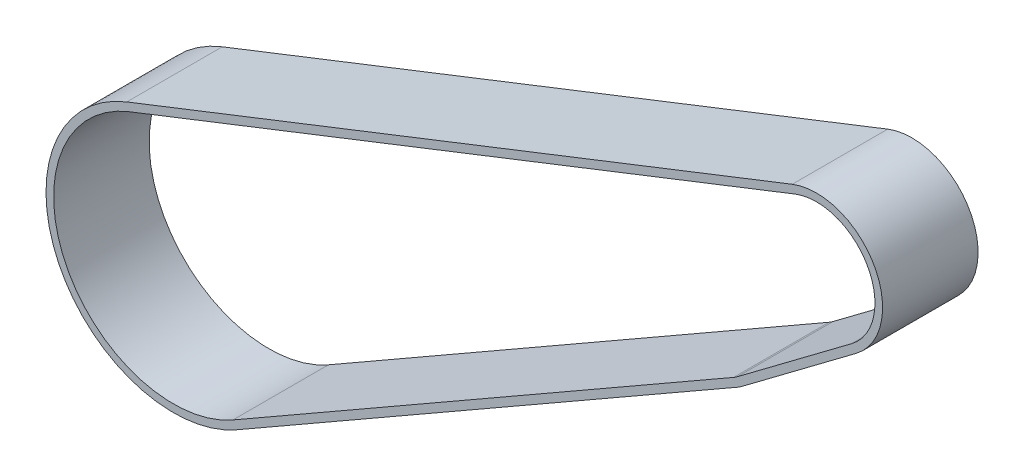
ISO-10303-21;
HEADER;
FILE_DESCRIPTION(('STEP AP214'),'2;1');
FILE_NAME('part.step','',(''),(''),'','','');
FILE_SCHEMA(('AUTOMOTIVE_DESIGN { 1 0 10303 214 1 1 1 1 }'));
ENDSEC;
DATA;
#1=APPLICATION_CONTEXT('core data for automotive mechanical design processes');
#2=APPLICATION_PROTOCOL_DEFINITION('international standard','automotive_design',2000,#1);
#3=PRODUCT_CONTEXT('',#1,'mechanical');
#4=PRODUCT('Part','Part','',(#3));
#5=PRODUCT_RELATED_PRODUCT_CATEGORY('part','',(#4));
#6=PRODUCT_DEFINITION_FORMATION('','',#4);
#7=PRODUCT_DEFINITION_CONTEXT('part definition',#1,'design');
#8=PRODUCT_DEFINITION('design','',#6,#7);
#9=PRODUCT_DEFINITION_SHAPE('','',#8);
#10=(LENGTH_UNIT() NAMED_UNIT(*) SI_UNIT(.MILLI.,.METRE.));
#11=(NAMED_UNIT(*) PLANE_ANGLE_UNIT() SI_UNIT($,.RADIAN.));
#12=(NAMED_UNIT(*) SI_UNIT($,.STERADIAN.) SOLID_ANGLE_UNIT());
#13=UNCERTAINTY_MEASURE_WITH_UNIT(LENGTH_MEASURE(1.E-05),#10,'distance_accuracy_value','');
#14=(GEOMETRIC_REPRESENTATION_CONTEXT(3) GLOBAL_UNCERTAINTY_ASSIGNED_CONTEXT((#13)) GLOBAL_UNIT_ASSIGNED_CONTEXT((#10,
#11,#12)) REPRESENTATION_CONTEXT('',''));
#15=CARTESIAN_POINT('',(0.,0.,0.));
#16=DIRECTION('',(0.,0.,1.));
#17=DIRECTION('',(1.,0.,0.));
#18=AXIS2_PLACEMENT_3D('',#15,#16,#17);
#19=CARTESIAN_POINT('',(-336.89025787332,-23.2314605364085,15.));
#20=DIRECTION('',(0.,0.,1.));
#21=DIRECTION('',(1.,0.,0.));
#22=AXIS2_PLACEMENT_3D('',#19,#20,#21);
#23=PLANE('',#22);
#24=CARTESIAN_POINT('',(-336.89025787332,-23.2314605364085,15.));
#25=DIRECTION('',(0.,0.,1.));
#26=DIRECTION('',(1.,0.,0.));
#27=AXIS2_PLACEMENT_3D('',#24,#25,#26);
#28=CIRCLE('',#27,10.3936776492283);
#29=CARTESIAN_POINT('',(-330.651704705237,-31.5446422044022,15.));
#30=VERTEX_POINT('',#29);
#31=CARTESIAN_POINT('',(-340.690762011991,-13.5575418181219,15.));
#32=VERTEX_POINT('',#31);
#33=EDGE_CURVE('E234',#30,#32,#28,.T.);
#34=ORIENTED_EDGE('',*,*,#33,.T.);
#35=DIRECTION('',(-0.93075031233096,-0.365655378868984,0.));
#36=VECTOR('',#35,1.);
#37=CARTESIAN_POINT('',(-340.690762011991,-13.5575418181219,15.));
#38=LINE('',#37,#36);
#39=CARTESIAN_POINT('',(-445.203365450699,-54.6164542897791,15.));
#40=VERTEX_POINT('',#39);
#41=EDGE_CURVE('E238',#32,#40,#38,.T.);
#42=ORIENTED_EDGE('',*,*,#41,.T.);
#43=CARTESIAN_POINT('',(-437.890257873319,-73.2314605363983,15.));
#44=DIRECTION('',(0.,0.,1.));
#45=DIRECTION('',(1.,0.,0.));
#46=AXIS2_PLACEMENT_3D('',#43,#44,#45);
#47=CIRCLE('',#46,20.);
#48=CARTESIAN_POINT('',(-427.939056890706,-90.5800512285453,15.));
#49=VERTEX_POINT('',#48);
#50=EDGE_CURVE('E242',#40,#49,#47,.T.);
#51=ORIENTED_EDGE('',*,*,#50,.T.);
#52=DIRECTION('',(0.867429534607351,0.497560049130631,0.));
#53=VECTOR('',#52,1.);
#54=CARTESIAN_POINT('',(-427.939056890706,-90.5800512285453,15.));
#55=LINE('',#54,#53);
#56=CARTESIAN_POINT('',(-349.307825521008,-45.4769531870212,15.));
#57=VERTEX_POINT('',#56);
#58=EDGE_CURVE('E245',#49,#57,#55,.T.);
#59=ORIENTED_EDGE('',*,*,#58,.T.);
#60=CARTESIAN_POINT('',(-352.890257874749,-39.2314605378483,15.));
#61=DIRECTION('',(0.,0.,1.));
#62=DIRECTION('',(1.,0.,0.));
#63=AXIS2_PLACEMENT_3D('',#60,#61,#62);
#64=CIRCLE('',#63,7.2);
#65=CARTESIAN_POINT('',(-348.568632332174,-44.990241022444,15.));
#66=VERTEX_POINT('',#65);
#67=EDGE_CURVE('E248',#57,#66,#64,.T.);
#68=ORIENTED_EDGE('',*,*,#67,.T.);
#69=DIRECTION('',(0.799830622860516,0.60022576980213,0.));
#70=VECTOR('',#69,1.);
#71=CARTESIAN_POINT('',(-348.568632332174,-44.990241022444,15.));
#72=LINE('',#71,#70);
#73=EDGE_CURVE('E251',#66,#30,#72,.T.);
#74=ORIENTED_EDGE('',*,*,#73,.T.);
#75=EDGE_LOOP('',(#34,#42,#51,#59,#68,#74));
#76=FACE_BOUND('',#75,.T.);
#77=DIRECTION('',(-0.93075031233096,-0.365655378868984,0.));
#78=VECTOR('',#77,1.);
#79=CARTESIAN_POINT('',(-340.251975557348,-14.674442192919,15.));
#80=LINE('',#79,#78);
#81=CARTESIAN_POINT('',(-340.251975557348,-14.674442192919,15.));
#82=VERTEX_POINT('',#81);
#83=CARTESIAN_POINT('',(-444.764578996056,-55.7333546645762,15.));
#84=VERTEX_POINT('',#83);
#85=EDGE_CURVE('E174',#82,#84,#80,.T.);
#86=ORIENTED_EDGE('',*,*,#85,.F.);
#87=CARTESIAN_POINT('',(-336.89025787332,-23.2314605364085,15.));
#88=DIRECTION('',(0.,0.,1.));
#89=DIRECTION('',(1.,0.,0.));
#90=AXIS2_PLACEMENT_3D('',#87,#88,#89);
#91=CIRCLE('',#90,9.19367764922834);
#92=CARTESIAN_POINT('',(-331.371975629,-30.5848454569696,15.));
#93=VERTEX_POINT('',#92);
#94=EDGE_CURVE('E165',#93,#82,#91,.T.);
#95=ORIENTED_EDGE('',*,*,#94,.F.);
#96=DIRECTION('',(0.799830622860516,0.60022576980213,0.));
#97=VECTOR('',#96,1.);
#98=CARTESIAN_POINT('',(-349.288903255936,-44.0304442750114,15.));
#99=LINE('',#98,#97);
#100=CARTESIAN_POINT('',(-349.288903255936,-44.0304442750113,15.));
#101=VERTEX_POINT('',#100);
#102=EDGE_CURVE('E200',#101,#93,#99,.T.);
#103=ORIENTED_EDGE('',*,*,#102,.F.);
#104=CARTESIAN_POINT('',(-352.890257874749,-39.2314605378483,15.));
#105=DIRECTION('',(0.,0.,1.));
#106=DIRECTION('',(1.,0.,0.));
#107=AXIS2_PLACEMENT_3D('',#104,#105,#106);
#108=CIRCLE('',#107,6.00000000000001);
#109=CARTESIAN_POINT('',(-349.904897579965,-44.4360377454924,15.));
#110=VERTEX_POINT('',#109);
#111=EDGE_CURVE('E197',#110,#101,#108,.T.);
#112=ORIENTED_EDGE('',*,*,#111,.F.);
#113=DIRECTION('',(0.86742953460735,0.497560049130631,0.));
#114=VECTOR('',#113,1.);
#115=CARTESIAN_POINT('',(-428.536128949663,-89.5391357870165,15.));
#116=LINE('',#115,#114);
#117=CARTESIAN_POINT('',(-428.536128949663,-89.5391357870165,15.));
#118=VERTEX_POINT('',#117);
#119=EDGE_CURVE('E192',#118,#110,#116,.T.);
#120=ORIENTED_EDGE('',*,*,#119,.F.);
#121=CARTESIAN_POINT('',(-437.890257873319,-73.2314605363983,15.));
#122=DIRECTION('',(0.,0.,1.));
#123=DIRECTION('',(1.,0.,0.));
#124=AXIS2_PLACEMENT_3D('',#121,#122,#123);
#125=CIRCLE('',#124,18.8);
#126=EDGE_CURVE('E188',#84,#118,#125,.T.);
#127=ORIENTED_EDGE('',*,*,#126,.F.);
#128=EDGE_LOOP('',(#86,#95,#103,#112,#120,#127));
#129=FACE_BOUND('',#128,.T.);
#130=ADVANCED_FACE('F75',(#76,#129),#23,.T.);
#131=CARTESIAN_POINT('',(-336.89025787332,-23.2314605364085,0.));
#132=DIRECTION('',(0.,0.,1.));
#133=DIRECTION('',(1.,0.,0.));
#134=AXIS2_PLACEMENT_3D('',#131,#132,#133);
#135=PLANE('',#134);
#136=CARTESIAN_POINT('',(-336.89025787332,-23.2314605364085,0.));
#137=DIRECTION('',(0.,0.,1.));
#138=DIRECTION('',(1.,0.,0.));
#139=AXIS2_PLACEMENT_3D('',#136,#137,#138);
#140=CIRCLE('',#139,10.3936776492283);
#141=CARTESIAN_POINT('',(-330.651704705237,-31.5446422044022,0.));
#142=VERTEX_POINT('',#141);
#143=CARTESIAN_POINT('',(-340.690762011991,-13.5575418181219,0.));
#144=VERTEX_POINT('',#143);
#145=EDGE_CURVE('E183',#142,#144,#140,.T.);
#146=ORIENTED_EDGE('',*,*,#145,.F.);
#147=DIRECTION('',(0.799830622860516,0.60022576980213,0.));
#148=VECTOR('',#147,1.);
#149=CARTESIAN_POINT('',(-348.568632332174,-44.990241022444,0.));
#150=LINE('',#149,#148);
#151=CARTESIAN_POINT('',(-348.568632332174,-44.990241022444,0.));
#152=VERTEX_POINT('',#151);
#153=EDGE_CURVE('E239',#152,#142,#150,.T.);
#154=ORIENTED_EDGE('',*,*,#153,.F.);
#155=CARTESIAN_POINT('',(-352.890257874749,-39.2314605378483,0.));
#156=DIRECTION('',(0.,0.,1.));
#157=DIRECTION('',(1.,0.,0.));
#158=AXIS2_PLACEMENT_3D('',#155,#156,#157);
#159=CIRCLE('',#158,7.2);
#160=CARTESIAN_POINT('',(-349.307825521008,-45.4769531870212,0.));
#161=VERTEX_POINT('',#160);
#162=EDGE_CURVE('E267',#161,#152,#159,.T.);
#163=ORIENTED_EDGE('',*,*,#162,.F.);
#164=DIRECTION('',(0.867429534607351,0.497560049130631,0.));
#165=VECTOR('',#164,1.);
#166=CARTESIAN_POINT('',(-427.939056890706,-90.5800512285453,0.));
#167=LINE('',#166,#165);
#168=CARTESIAN_POINT('',(-427.939056890706,-90.5800512285453,0.));
#169=VERTEX_POINT('',#168);
#170=EDGE_CURVE('E264',#169,#161,#167,.T.);
#171=ORIENTED_EDGE('',*,*,#170,.F.);
#172=CARTESIAN_POINT('',(-437.890257873319,-73.2314605363983,0.));
#173=DIRECTION('',(0.,0.,1.));
#174=DIRECTION('',(1.,0.,0.));
#175=AXIS2_PLACEMENT_3D('',#172,#173,#174);
#176=CIRCLE('',#175,20.);
#177=CARTESIAN_POINT('',(-445.203365450699,-54.6164542897791,0.));
#178=VERTEX_POINT('',#177);
#179=EDGE_CURVE('E261',#178,#169,#176,.T.);
#180=ORIENTED_EDGE('',*,*,#179,.F.);
#181=DIRECTION('',(-0.93075031233096,-0.365655378868984,0.));
#182=VECTOR('',#181,1.);
#183=CARTESIAN_POINT('',(-340.690762011991,-13.5575418181219,0.));
#184=LINE('',#183,#182);
#185=EDGE_CURVE('E258',#144,#178,#184,.T.);
#186=ORIENTED_EDGE('',*,*,#185,.F.);
#187=EDGE_LOOP('',(#146,#154,#163,#171,#180,#186));
#188=FACE_BOUND('',#187,.T.);
#189=CARTESIAN_POINT('',(-336.89025787332,-23.2314605364085,0.));
#190=DIRECTION('',(0.,0.,1.));
#191=DIRECTION('',(1.,0.,0.));
#192=AXIS2_PLACEMENT_3D('',#189,#190,#191);
#193=CIRCLE('',#192,9.19367764922834);
#194=CARTESIAN_POINT('',(-331.371975629,-30.5848454569696,0.));
#195=VERTEX_POINT('',#194);
#196=CARTESIAN_POINT('',(-340.251975557348,-14.674442192919,0.));
#197=VERTEX_POINT('',#196);
#198=EDGE_CURVE('E99',#195,#197,#193,.T.);
#199=ORIENTED_EDGE('',*,*,#198,.T.);
#200=DIRECTION('',(-0.93075031233096,-0.365655378868984,0.));
#201=VECTOR('',#200,1.);
#202=CARTESIAN_POINT('',(-340.251975557348,-14.674442192919,0.));
#203=LINE('',#202,#201);
#204=CARTESIAN_POINT('',(-444.764578996056,-55.7333546645762,0.));
#205=VERTEX_POINT('',#204);
#206=EDGE_CURVE('E181',#197,#205,#203,.T.);
#207=ORIENTED_EDGE('',*,*,#206,.T.);
#208=CARTESIAN_POINT('',(-437.890257873319,-73.2314605363983,0.));
#209=DIRECTION('',(0.,0.,1.));
#210=DIRECTION('',(1.,0.,0.));
#211=AXIS2_PLACEMENT_3D('',#208,#209,#210);
#212=CIRCLE('',#211,18.8);
#213=CARTESIAN_POINT('',(-428.536128949663,-89.5391357870165,0.));
#214=VERTEX_POINT('',#213);
#215=EDGE_CURVE('E207',#205,#214,#212,.T.);
#216=ORIENTED_EDGE('',*,*,#215,.T.);
#217=DIRECTION('',(0.86742953460735,0.497560049130631,0.));
#218=VECTOR('',#217,1.);
#219=CARTESIAN_POINT('',(-428.536128949663,-89.5391357870165,0.));
#220=LINE('',#219,#218);
#221=CARTESIAN_POINT('',(-349.904897579965,-44.4360377454924,0.));
#222=VERTEX_POINT('',#221);
#223=EDGE_CURVE('E211',#214,#222,#220,.T.);
#224=ORIENTED_EDGE('',*,*,#223,.T.);
#225=CARTESIAN_POINT('',(-352.890257874749,-39.2314605378483,0.));
#226=DIRECTION('',(0.,0.,1.));
#227=DIRECTION('',(1.,0.,0.));
#228=AXIS2_PLACEMENT_3D('',#225,#226,#227);
#229=CIRCLE('',#228,6.00000000000001);
#230=CARTESIAN_POINT('',(-349.288903255936,-44.0304442750114,0.));
#231=VERTEX_POINT('',#230);
#232=EDGE_CURVE('E215',#222,#231,#229,.T.);
#233=ORIENTED_EDGE('',*,*,#232,.T.);
#234=DIRECTION('',(0.799830622860516,0.60022576980213,0.));
#235=VECTOR('',#234,1.);
#236=CARTESIAN_POINT('',(-349.288903255936,-44.0304442750114,0.));
#237=LINE('',#236,#235);
#238=EDGE_CURVE('E175',#231,#195,#237,.T.);
#239=ORIENTED_EDGE('',*,*,#238,.T.);
#240=EDGE_LOOP('',(#199,#207,#216,#224,#233,#239));
#241=FACE_BOUND('',#240,.T.);
#242=ADVANCED_FACE('F298',(#188,#241),#135,.F.);
#243=CARTESIAN_POINT('',(-336.89025787332,-23.2314605364085,15.));
#244=DIRECTION('',(0.,0.,-1.));
#245=DIRECTION('',(-1.,0.,0.));
#246=AXIS2_PLACEMENT_3D('',#243,#244,#245);
#247=CYLINDRICAL_SURFACE('',#246,10.3936776492283);
#248=ORIENTED_EDGE('',*,*,#145,.T.);
#249=DIRECTION('',(0.,0.,-1.));
#250=VECTOR('',#249,1.);
#251=CARTESIAN_POINT('',(-340.690762011991,-13.5575418181219,15.));
#252=LINE('',#251,#250);
#253=EDGE_CURVE('E12',#32,#144,#252,.T.);
#254=ORIENTED_EDGE('',*,*,#253,.F.);
#255=ORIENTED_EDGE('',*,*,#33,.F.);
#256=DIRECTION('',(0.,0.,-1.));
#257=VECTOR('',#256,1.);
#258=CARTESIAN_POINT('',(-330.651704705237,-31.5446422044022,15.));
#259=LINE('',#258,#257);
#260=EDGE_CURVE('E254',#30,#142,#259,.T.);
#261=ORIENTED_EDGE('',*,*,#260,.T.);
#262=EDGE_LOOP('',(#248,#254,#255,#261));
#263=FACE_BOUND('',#262,.T.);
#264=ADVANCED_FACE('F77',(#263),#247,.T.);
#265=CARTESIAN_POINT('',(-340.690762011991,-13.5575418181219,15.));
#266=DIRECTION('',(0.365655378868984,-0.93075031233096,0.));
#267=DIRECTION('',(0.93075031233096,0.365655378868984,0.));
#268=AXIS2_PLACEMENT_3D('',#265,#266,#267);
#269=PLANE('',#268);
#270=ORIENTED_EDGE('',*,*,#185,.T.);
#271=DIRECTION('',(0.,0.,-1.));
#272=VECTOR('',#271,1.);
#273=CARTESIAN_POINT('',(-445.203365450699,-54.6164542897791,15.));
#274=LINE('',#273,#272);
#275=EDGE_CURVE('E84',#40,#178,#274,.T.);
#276=ORIENTED_EDGE('',*,*,#275,.F.);
#277=ORIENTED_EDGE('',*,*,#41,.F.);
#278=ORIENTED_EDGE('',*,*,#253,.T.);
#279=EDGE_LOOP('',(#270,#276,#277,#278));
#280=FACE_BOUND('',#279,.T.);
#281=ADVANCED_FACE('F315',(#280),#269,.F.);
#282=CARTESIAN_POINT('',(-437.890257873319,-73.2314605363983,15.));
#283=DIRECTION('',(0.,0.,-1.));
#284=DIRECTION('',(-1.,0.,0.));
#285=AXIS2_PLACEMENT_3D('',#282,#283,#284);
#286=CYLINDRICAL_SURFACE('',#285,20.);
#287=ORIENTED_EDGE('',*,*,#179,.T.);
#288=DIRECTION('',(0.,0.,-1.));
#289=VECTOR('',#288,1.);
#290=CARTESIAN_POINT('',(-427.939056890706,-90.5800512285453,15.));
#291=LINE('',#290,#289);
#292=EDGE_CURVE('E283',#49,#169,#291,.T.);
#293=ORIENTED_EDGE('',*,*,#292,.F.);
#294=ORIENTED_EDGE('',*,*,#50,.F.);
#295=ORIENTED_EDGE('',*,*,#275,.T.);
#296=EDGE_LOOP('',(#287,#293,#294,#295));
#297=FACE_BOUND('',#296,.T.);
#298=ADVANCED_FACE('F292',(#297),#286,.T.);
#299=CARTESIAN_POINT('',(-427.939056890706,-90.5800512285453,15.));
#300=DIRECTION('',(-0.497560049130631,0.86742953460735,0.));
#301=DIRECTION('',(-0.86742953460735,-0.497560049130631,0.));
#302=AXIS2_PLACEMENT_3D('',#299,#300,#301);
#303=PLANE('',#302);
#304=ORIENTED_EDGE('',*,*,#170,.T.);
#305=DIRECTION('',(0.,0.,-1.));
#306=VECTOR('',#305,1.);
#307=CARTESIAN_POINT('',(-349.307825521008,-45.4769531870212,15.));
#308=LINE('',#307,#306);
#309=EDGE_CURVE('E279',#57,#161,#308,.T.);
#310=ORIENTED_EDGE('',*,*,#309,.F.);
#311=ORIENTED_EDGE('',*,*,#58,.F.);
#312=ORIENTED_EDGE('',*,*,#292,.T.);
#313=EDGE_LOOP('',(#304,#310,#311,#312));
#314=FACE_BOUND('',#313,.T.);
#315=ADVANCED_FACE('F304',(#314),#303,.F.);
#316=CARTESIAN_POINT('',(-352.890257874749,-39.2314605378483,15.));
#317=DIRECTION('',(0.,0.,-1.));
#318=DIRECTION('',(-1.,0.,0.));
#319=AXIS2_PLACEMENT_3D('',#316,#317,#318);
#320=CYLINDRICAL_SURFACE('',#319,7.2);
#321=ORIENTED_EDGE('',*,*,#162,.T.);
#322=DIRECTION('',(0.,0.,-1.));
#323=VECTOR('',#322,1.);
#324=CARTESIAN_POINT('',(-348.568632332174,-44.990241022444,15.));
#325=LINE('',#324,#323);
#326=EDGE_CURVE('E275',#66,#152,#325,.T.);
#327=ORIENTED_EDGE('',*,*,#326,.F.);
#328=ORIENTED_EDGE('',*,*,#67,.F.);
#329=ORIENTED_EDGE('',*,*,#309,.T.);
#330=EDGE_LOOP('',(#321,#327,#328,#329));
#331=FACE_BOUND('',#330,.T.);
#332=ADVANCED_FACE('F308',(#331),#320,.T.);
#333=CARTESIAN_POINT('',(-348.568632332174,-44.990241022444,15.));
#334=DIRECTION('',(-0.60022576980213,0.799830622860516,0.));
#335=DIRECTION('',(-0.799830622860516,-0.60022576980213,0.));
#336=AXIS2_PLACEMENT_3D('',#333,#334,#335);
#337=PLANE('',#336);
#338=ORIENTED_EDGE('',*,*,#153,.T.);
#339=ORIENTED_EDGE('',*,*,#260,.F.);
#340=ORIENTED_EDGE('',*,*,#73,.F.);
#341=ORIENTED_EDGE('',*,*,#326,.T.);
#342=EDGE_LOOP('',(#338,#339,#340,#341));
#343=FACE_BOUND('',#342,.T.);
#344=ADVANCED_FACE('F318',(#343),#337,.F.);
#345=CARTESIAN_POINT('',(-336.89025787332,-23.2314605364085,15.));
#346=DIRECTION('',(0.,0.,-1.));
#347=DIRECTION('',(-1.,0.,0.));
#348=AXIS2_PLACEMENT_3D('',#345,#346,#347);
#349=CYLINDRICAL_SURFACE('',#348,9.19367764922834);
#350=ORIENTED_EDGE('',*,*,#198,.F.);
#351=DIRECTION('',(0.,0.,-1.));
#352=VECTOR('',#351,1.);
#353=CARTESIAN_POINT('',(-331.371975629,-30.5848454569696,15.));
#354=LINE('',#353,#352);
#355=EDGE_CURVE('E169',#93,#195,#354,.T.);
#356=ORIENTED_EDGE('',*,*,#355,.F.);
#357=ORIENTED_EDGE('',*,*,#94,.T.);
#358=DIRECTION('',(0.,0.,-1.));
#359=VECTOR('',#358,1.);
#360=CARTESIAN_POINT('',(-340.251975557348,-14.674442192919,15.));
#361=LINE('',#360,#359);
#362=EDGE_CURVE('E168',#82,#197,#361,.T.);
#363=ORIENTED_EDGE('',*,*,#362,.T.);
#364=EDGE_LOOP('',(#350,#356,#357,#363));
#365=FACE_BOUND('',#364,.T.);
#366=ADVANCED_FACE('F167',(#365),#349,.F.);
#367=CARTESIAN_POINT('',(-340.251975557348,-14.674442192919,15.));
#368=DIRECTION('',(0.365655378868984,-0.93075031233096,0.));
#369=DIRECTION('',(0.93075031233096,0.365655378868984,0.));
#370=AXIS2_PLACEMENT_3D('',#367,#368,#369);
#371=PLANE('',#370);
#372=ORIENTED_EDGE('',*,*,#206,.F.);
#373=ORIENTED_EDGE('',*,*,#362,.F.);
#374=ORIENTED_EDGE('',*,*,#85,.T.);
#375=DIRECTION('',(0.,0.,-1.));
#376=VECTOR('',#375,1.);
#377=CARTESIAN_POINT('',(-444.764578996056,-55.7333546645762,15.));
#378=LINE('',#377,#376);
#379=EDGE_CURVE('E184',#84,#205,#378,.T.);
#380=ORIENTED_EDGE('',*,*,#379,.T.);
#381=EDGE_LOOP('',(#372,#373,#374,#380));
#382=FACE_BOUND('',#381,.T.);
#383=ADVANCED_FACE('F178',(#382),#371,.T.);
#384=CARTESIAN_POINT('',(-437.890257873319,-73.2314605363983,15.));
#385=DIRECTION('',(0.,0.,-1.));
#386=DIRECTION('',(-1.,0.,0.));
#387=AXIS2_PLACEMENT_3D('',#384,#385,#386);
#388=CYLINDRICAL_SURFACE('',#387,18.8);
#389=ORIENTED_EDGE('',*,*,#215,.F.);
#390=ORIENTED_EDGE('',*,*,#379,.F.);
#391=ORIENTED_EDGE('',*,*,#126,.T.);
#392=DIRECTION('',(0.,0.,-1.));
#393=VECTOR('',#392,1.);
#394=CARTESIAN_POINT('',(-428.536128949663,-89.5391357870165,15.));
#395=LINE('',#394,#393);
#396=EDGE_CURVE('E229',#118,#214,#395,.T.);
#397=ORIENTED_EDGE('',*,*,#396,.T.);
#398=EDGE_LOOP('',(#389,#390,#391,#397));
#399=FACE_BOUND('',#398,.T.);
#400=ADVANCED_FACE('F336',(#399),#388,.F.);
#401=CARTESIAN_POINT('',(-428.536128949663,-89.5391357870165,15.));
#402=DIRECTION('',(-0.497560049130631,0.86742953460735,0.));
#403=DIRECTION('',(-0.867429534607351,-0.497560049130631,0.));
#404=AXIS2_PLACEMENT_3D('',#401,#402,#403);
#405=PLANE('',#404);
#406=ORIENTED_EDGE('',*,*,#223,.F.);
#407=ORIENTED_EDGE('',*,*,#396,.F.);
#408=ORIENTED_EDGE('',*,*,#119,.T.);
#409=DIRECTION('',(0.,0.,-1.));
#410=VECTOR('',#409,1.);
#411=CARTESIAN_POINT('',(-349.904897579965,-44.4360377454924,15.));
#412=LINE('',#411,#410);
#413=EDGE_CURVE('E226',#110,#222,#412,.T.);
#414=ORIENTED_EDGE('',*,*,#413,.T.);
#415=EDGE_LOOP('',(#406,#407,#408,#414));
#416=FACE_BOUND('',#415,.T.);
#417=ADVANCED_FACE('F339',(#416),#405,.T.);
#418=CARTESIAN_POINT('',(-352.890257874749,-39.2314605378483,15.));
#419=DIRECTION('',(0.,0.,-1.));
#420=DIRECTION('',(-1.,0.,0.));
#421=AXIS2_PLACEMENT_3D('',#418,#419,#420);
#422=CYLINDRICAL_SURFACE('',#421,6.00000000000001);
#423=ORIENTED_EDGE('',*,*,#232,.F.);
#424=ORIENTED_EDGE('',*,*,#413,.F.);
#425=ORIENTED_EDGE('',*,*,#111,.T.);
#426=DIRECTION('',(0.,0.,-1.));
#427=VECTOR('',#426,1.);
#428=CARTESIAN_POINT('',(-349.288903255936,-44.0304442750114,15.));
#429=LINE('',#428,#427);
#430=EDGE_CURVE('E91',#101,#231,#429,.T.);
#431=ORIENTED_EDGE('',*,*,#430,.T.);
#432=EDGE_LOOP('',(#423,#424,#425,#431));
#433=FACE_BOUND('',#432,.T.);
#434=ADVANCED_FACE('F343',(#433),#422,.F.);
#435=CARTESIAN_POINT('',(-349.288903255936,-44.0304442750114,15.));
#436=DIRECTION('',(-0.60022576980213,0.799830622860516,0.));
#437=DIRECTION('',(-0.799830622860516,-0.60022576980213,0.));
#438=AXIS2_PLACEMENT_3D('',#435,#436,#437);
#439=PLANE('',#438);
#440=ORIENTED_EDGE('',*,*,#238,.F.);
#441=ORIENTED_EDGE('',*,*,#430,.F.);
#442=ORIENTED_EDGE('',*,*,#102,.T.);
#443=ORIENTED_EDGE('',*,*,#355,.T.);
#444=EDGE_LOOP('',(#440,#441,#442,#443));
#445=FACE_BOUND('',#444,.T.);
#446=ADVANCED_FACE('F347',(#445),#439,.T.);
#447=CLOSED_SHELL('',(#130,#242,#264,#281,#298,#315,#332,#344,#366,#383,#400,#417,#434,#446));
#448=MANIFOLD_SOLID_BREP('B2',#447);
#449=ADVANCED_BREP_SHAPE_REPRESENTATION('',(#18,#448),#14);
#450=SHAPE_DEFINITION_REPRESENTATION(#9,#449);
ENDSEC;
END-ISO-10303-21;
